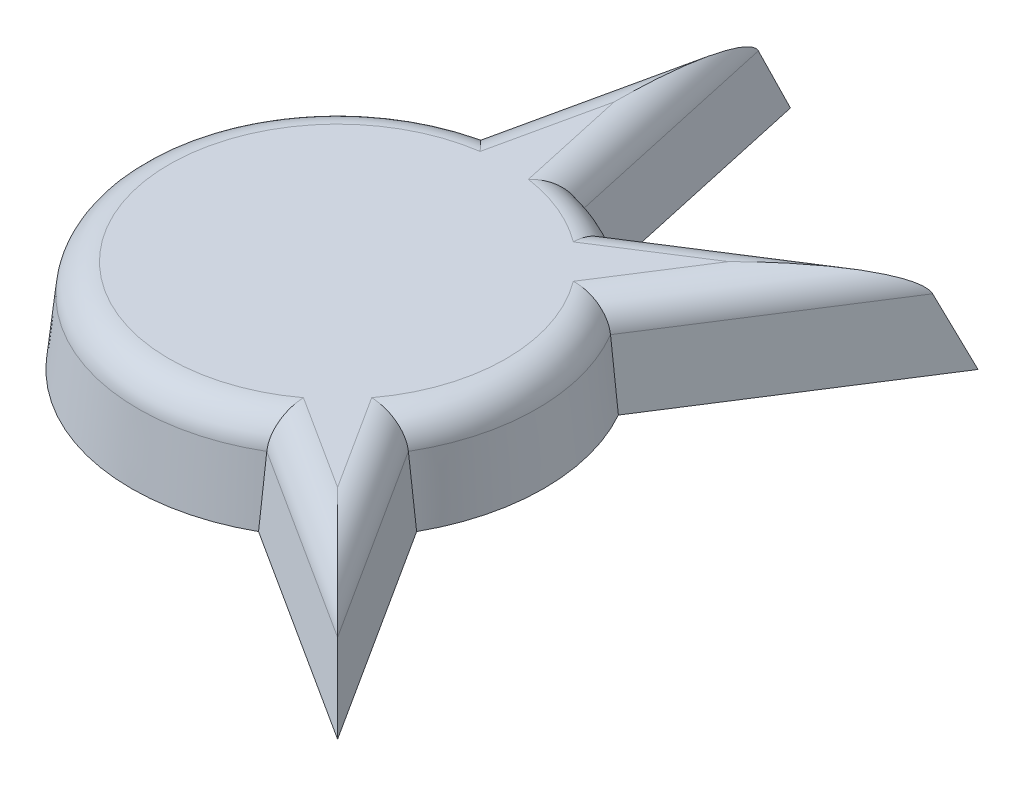
ISO-10303-21;
HEADER;
FILE_DESCRIPTION(('STEP AP214'),'2;1');
FILE_NAME('part.step','',(''),(''),'','','');
FILE_SCHEMA(('AUTOMOTIVE_DESIGN { 1 0 10303 214 1 1 1 1 }'));
ENDSEC;
DATA;
#1=APPLICATION_CONTEXT('core data for automotive mechanical design processes');
#2=APPLICATION_PROTOCOL_DEFINITION('international standard','automotive_design',2000,#1);
#3=PRODUCT_CONTEXT('',#1,'mechanical');
#4=PRODUCT('Part','Part','',(#3));
#5=PRODUCT_RELATED_PRODUCT_CATEGORY('part','',(#4));
#6=PRODUCT_DEFINITION_FORMATION('','',#4);
#7=PRODUCT_DEFINITION_CONTEXT('part definition',#1,'design');
#8=PRODUCT_DEFINITION('design','',#6,#7);
#9=PRODUCT_DEFINITION_SHAPE('','',#8);
#10=(LENGTH_UNIT() NAMED_UNIT(*) SI_UNIT(.MILLI.,.METRE.));
#11=(NAMED_UNIT(*) PLANE_ANGLE_UNIT() SI_UNIT($,.RADIAN.));
#12=(NAMED_UNIT(*) SI_UNIT($,.STERADIAN.) SOLID_ANGLE_UNIT());
#13=UNCERTAINTY_MEASURE_WITH_UNIT(LENGTH_MEASURE(1.E-05),#10,'distance_accuracy_value','');
#14=(GEOMETRIC_REPRESENTATION_CONTEXT(3) GLOBAL_UNCERTAINTY_ASSIGNED_CONTEXT((#13)) GLOBAL_UNIT_ASSIGNED_CONTEXT((#10,
#11,#12)) REPRESENTATION_CONTEXT('',''));
#15=CARTESIAN_POINT('',(0.,0.,0.));
#16=DIRECTION('',(0.,0.,1.));
#17=DIRECTION('',(1.,0.,0.));
#18=AXIS2_PLACEMENT_3D('',#15,#16,#17);
#19=CARTESIAN_POINT('',(0.,0.,0.));
#20=DIRECTION('',(0.,-1.,0.));
#21=DIRECTION('',(0.,0.,1.));
#22=AXIS2_PLACEMENT_3D('',#19,#20,#21);
#23=CONICAL_SURFACE('',#22,6.62463400876314,0.10471975511966);
#24=CARTESIAN_POINT('',(3.24787269852485,3.,5.4091457956168));
#25=CARTESIAN_POINT('',(3.24699003087964,2.50003379183349,5.47095982785389));
#26=CARTESIAN_POINT('',(3.24588174433896,2.00005068603496,5.53263165590073));
#27=CARTESIAN_POINT('',(3.243213933485,1.0000506860345,5.65569090276962));
#28=CARTESIAN_POINT('',(3.2416544091779,0.500033791833026,5.71707832159558));
#29=CARTESIAN_POINT('',(3.23986926598154,0.,5.77832353623518));
#30=B_SPLINE_CURVE_WITH_KNOTS('',3,(#24,#25,#26,#27,#28,#29),.UNSPECIFIED.,.F.,.F.,(4,2,4),(0.,
1.51132052815368,3.02264103557015),.UNSPECIFIED.);
#31=CARTESIAN_POINT('',(3.24605440651761,2.10452846326765,5.51970685719593));
#32=VERTEX_POINT('',#31);
#33=CARTESIAN_POINT('',(3.23986926598154,0.,5.77832353623518));
#34=VERTEX_POINT('',#33);
#35=EDGE_CURVE('E137',#32,#34,#30,.T.);
#36=ORIENTED_EDGE('',*,*,#35,.F.);
#37=CARTESIAN_POINT('',(0.,2.10452846326765,0.));
#38=DIRECTION('',(0.,-1.,0.));
#39=DIRECTION('',(0.,0.,-1.));
#40=AXIS2_PLACEMENT_3D('',#37,#38,#39);
#41=CIRCLE('',#40,6.40343915403654);
#42=CARTESIAN_POINT('',(-1.60771506593602,2.10452846326765,-6.19832923183422));
#43=VERTEX_POINT('',#42);
#44=EDGE_CURVE('E11',#32,#43,#41,.T.);
#45=ORIENTED_EDGE('',*,*,#44,.T.);
#46=CARTESIAN_POINT('',(-1.52825086294973,3.,-6.12143648206492));
#47=CARTESIAN_POINT('',(-1.57258412459453,2.50003379183349,-6.16452146315479));
#48=CARTESIAN_POINT('',(-1.61697636934303,2.00005068603496,-6.20734635404647));
#49=CARTESIAN_POINT('',(-1.70587882443749,1.0000506860345,-6.29247595484942));
#50=CARTESIAN_POINT('',(-1.75038903478184,0.500033791833026,-6.33478066476782));
#51=CARTESIAN_POINT('',(-1.79495822822827,0.,-6.37682528449516));
#52=B_SPLINE_CURVE_WITH_KNOTS('',3,(#46,#47,#48,#49,#50,#51),.UNSPECIFIED.,.F.,.F.,(4,2,4),(0.,
1.51132052815368,3.02264103557015),.UNSPECIFIED.);
#53=CARTESIAN_POINT('',(-1.79495822822827,0.,-6.37682528449516));
#54=VERTEX_POINT('',#53);
#55=EDGE_CURVE('E150',#43,#54,#52,.T.);
#56=ORIENTED_EDGE('',*,*,#55,.T.);
#57=CARTESIAN_POINT('',(0.,0.,0.));
#58=DIRECTION('',(0.,1.,0.));
#59=DIRECTION('',(0.,0.,1.));
#60=AXIS2_PLACEMENT_3D('',#57,#58,#59);
#61=CIRCLE('',#60,6.62463400876314);
#62=EDGE_CURVE('E148',#54,#34,#61,.T.);
#63=ORIENTED_EDGE('',*,*,#62,.T.);
#64=EDGE_LOOP('',(#36,#45,#56,#63));
#65=FACE_BOUND('',#64,.T.);
#66=ADVANCED_FACE('F35',(#65),#23,.T.);
#67=CARTESIAN_POINT('',(-1.68222862987204,0.,2.6300059792289));
#68=DIRECTION('',(-0.535880301772838,0.104528463267654,0.8377983662784));
#69=DIRECTION('',(0.842413193897718,0.,0.538832080287584));
#70=AXIS2_PLACEMENT_3D('',#67,#68,#69);
#71=PLANE('',#70);
#72=DIRECTION('',(-0.310943907825434,0.898124586219804,-0.310943907825437));
#73=VECTOR('',#72,1.);
#74=CARTESIAN_POINT('',(8.38689679368774,5.47919899962963,8.38689679368783));
#75=LINE('',#74,#73);
#76=CARTESIAN_POINT('',(9.55525724200413,2.10452846326765,9.55525724200423));
#77=VERTEX_POINT('',#76);
#78=CARTESIAN_POINT('',(10.2838758707989,0.,10.283875870799));
#79=VERTEX_POINT('',#78);
#80=EDGE_CURVE('E145',#77,#79,#75,.F.);
#81=ORIENTED_EDGE('',*,*,#80,.F.);
#82=DIRECTION('',(-0.842413193897718,0.,-0.538832080287584));
#83=VECTOR('',#82,1.);
#84=CARTESIAN_POINT('',(-1.5630417461508,2.10452846326765,2.44366851518492));
#85=LINE('',#84,#83);
#86=EDGE_CURVE('E49',#77,#32,#85,.T.);
#87=ORIENTED_EDGE('',*,*,#86,.T.);
#88=ORIENTED_EDGE('',*,*,#35,.T.);
#89=DIRECTION('',(-0.842413193897718,0.,-0.538832080287584));
#90=VECTOR('',#89,1.);
#91=CARTESIAN_POINT('',(-1.68222862987204,0.,2.6300059792289));
#92=LINE('',#91,#90);
#93=EDGE_CURVE('E141',#79,#34,#92,.T.);
#94=ORIENTED_EDGE('',*,*,#93,.F.);
#95=EDGE_LOOP('',(#81,#87,#88,#94));
#96=FACE_BOUND('',#95,.T.);
#97=ADVANCED_FACE('F139',(#96),#71,.T.);
#98=CARTESIAN_POINT('',(2.63000597922891,0.,-1.68222862987201));
#99=DIRECTION('',(0.837798366278405,0.104528463267654,-0.535880301772829));
#100=DIRECTION('',(-0.538832080287575,0.,-0.842413193897724));
#101=AXIS2_PLACEMENT_3D('',#98,#99,#100);
#102=PLANE('',#101);
#103=CARTESIAN_POINT('',(5.40914579561676,3.,3.24787269852491));
#104=CARTESIAN_POINT('',(5.47095982785386,2.50003379183349,3.2469900308797));
#105=CARTESIAN_POINT('',(5.53263165590069,2.00005068603496,3.24588174433902));
#106=CARTESIAN_POINT('',(5.65569090276959,1.0000506860345,3.24321393348506));
#107=CARTESIAN_POINT('',(5.71707832159554,0.500033791833026,3.24165440917796));
#108=CARTESIAN_POINT('',(5.77832353623514,0.,3.2398692659816));
#109=B_SPLINE_CURVE_WITH_KNOTS('',3,(#103,#104,#105,#106,#107,#108),.UNSPECIFIED.,.F.,.F.,(4,2,
4),(0.,1.51132052815368,3.02264103557015),.UNSPECIFIED.);
#110=CARTESIAN_POINT('',(5.51970685719591,2.10452846326754,3.24605440651767));
#111=VERTEX_POINT('',#110);
#112=CARTESIAN_POINT('',(5.77832353623514,0.,3.2398692659816));
#113=VERTEX_POINT('',#112);
#114=EDGE_CURVE('E237',#111,#113,#109,.T.);
#115=ORIENTED_EDGE('',*,*,#114,.F.);
#116=DIRECTION('',(-0.538832080287575,0.,-0.842413193897724));
#117=VECTOR('',#116,1.);
#118=CARTESIAN_POINT('',(9.32451797835626,2.10452846326765,9.19451814134885));
#119=LINE('',#118,#117);
#120=EDGE_CURVE('E64',#111,#77,#119,.F.);
#121=ORIENTED_EDGE('',*,*,#120,.T.);
#122=ORIENTED_EDGE('',*,*,#80,.T.);
#123=DIRECTION('',(-0.538832080287575,0.,-0.842413193897724));
#124=VECTOR('',#123,1.);
#125=CARTESIAN_POINT('',(2.63000597922891,0.,-1.68222862987201));
#126=LINE('',#125,#124);
#127=EDGE_CURVE('E161',#79,#113,#126,.T.);
#128=ORIENTED_EDGE('',*,*,#127,.T.);
#129=EDGE_LOOP('',(#115,#121,#122,#128));
#130=FACE_BOUND('',#129,.T.);
#131=ADVANCED_FACE('F243',(#130),#102,.T.);
#132=CARTESIAN_POINT('',(0.,0.,0.));
#133=DIRECTION('',(0.,-1.,0.));
#134=DIRECTION('',(0.,0.,1.));
#135=AXIS2_PLACEMENT_3D('',#132,#133,#134);
#136=CONICAL_SURFACE('',#135,6.62463400876314,0.10471975511966);
#137=CARTESIAN_POINT('',(5.40914579561679,3.,-3.24787269852487));
#138=CARTESIAN_POINT('',(5.47095982785388,2.50003379183349,-3.24699003087966));
#139=CARTESIAN_POINT('',(5.53263165590072,2.00005068603496,-3.24588174433898));
#140=CARTESIAN_POINT('',(5.65569090276961,1.0000506860345,-3.24321393348502));
#141=CARTESIAN_POINT('',(5.71707832159557,0.500033791833026,-3.24165440917792));
#142=CARTESIAN_POINT('',(5.77832353623517,0.,-3.23986926598156));
#143=B_SPLINE_CURVE_WITH_KNOTS('',3,(#137,#138,#139,#140,#141,#142),.UNSPECIFIED.,.F.,.F.,(4,2,
4),(0.,1.51132052815368,3.02264103557016),.UNSPECIFIED.);
#144=CARTESIAN_POINT('',(5.51970685719592,2.10452846326765,-3.24605440651763));
#145=VERTEX_POINT('',#144);
#146=CARTESIAN_POINT('',(5.77832353623517,0.,-3.23986926598156));
#147=VERTEX_POINT('',#146);
#148=EDGE_CURVE('E232',#145,#147,#143,.T.);
#149=ORIENTED_EDGE('',*,*,#148,.F.);
#150=CARTESIAN_POINT('',(0.,2.10452846326765,0.));
#151=DIRECTION('',(0.,-1.,0.));
#152=DIRECTION('',(0.,0.,-1.));
#153=AXIS2_PLACEMENT_3D('',#150,#151,#152);
#154=CIRCLE('',#153,6.40343915403654);
#155=EDGE_CURVE('E326',#145,#111,#154,.T.);
#156=ORIENTED_EDGE('',*,*,#155,.T.);
#157=ORIENTED_EDGE('',*,*,#114,.T.);
#158=EDGE_CURVE('E156',#113,#147,#61,.T.);
#159=ORIENTED_EDGE('',*,*,#158,.T.);
#160=EDGE_LOOP('',(#149,#156,#157,#159));
#161=FACE_BOUND('',#160,.T.);
#162=ADVANCED_FACE('F228',(#161),#136,.T.);
#163=CARTESIAN_POINT('',(2.6300059792289,0.,1.68222862987203));
#164=DIRECTION('',(0.837798366278402,0.104528463267654,0.535880301772835));
#165=DIRECTION('',(0.538832080287581,0.,-0.84241319389772));
#166=AXIS2_PLACEMENT_3D('',#163,#164,#165);
#167=PLANE('',#166);
#168=DIRECTION('',(-0.310943907825436,0.898124586219804,0.310943907825435));
#169=VECTOR('',#168,1.);
#170=CARTESIAN_POINT('',(8.3868967936878,5.47919899962963,-8.38689679368777));
#171=LINE('',#170,#169);
#172=CARTESIAN_POINT('',(9.5552572420042,2.10452846326765,-9.55525724200417));
#173=VERTEX_POINT('',#172);
#174=CARTESIAN_POINT('',(10.2838758707989,0.,-10.2838758707989));
#175=VERTEX_POINT('',#174);
#176=EDGE_CURVE('E217',#173,#175,#171,.F.);
#177=ORIENTED_EDGE('',*,*,#176,.F.);
#178=DIRECTION('',(-0.538832080287581,0.,0.84241319389772));
#179=VECTOR('',#178,1.);
#180=CARTESIAN_POINT('',(2.44366851518493,2.10452846326765,1.56304174615079));
#181=LINE('',#180,#179);
#182=EDGE_CURVE('E356',#173,#145,#181,.T.);
#183=ORIENTED_EDGE('',*,*,#182,.T.);
#184=ORIENTED_EDGE('',*,*,#148,.T.);
#185=DIRECTION('',(-0.538832080287581,0.,0.84241319389772));
#186=VECTOR('',#185,1.);
#187=CARTESIAN_POINT('',(2.6300059792289,0.,1.68222862987203));
#188=LINE('',#187,#186);
#189=EDGE_CURVE('E165',#175,#147,#188,.T.);
#190=ORIENTED_EDGE('',*,*,#189,.F.);
#191=EDGE_LOOP('',(#177,#183,#184,#190));
#192=FACE_BOUND('',#191,.T.);
#193=ADVANCED_FACE('F223',(#192),#167,.T.);
#194=CARTESIAN_POINT('',(-1.68222862987203,0.,-2.63000597922891));
#195=DIRECTION('',(-0.535880301772832,0.104528463267654,-0.837798366278403));
#196=DIRECTION('',(-0.842413193897722,0.,0.538832080287578));
#197=AXIS2_PLACEMENT_3D('',#194,#195,#196);
#198=PLANE('',#197);
#199=CARTESIAN_POINT('',(3.24787269852489,3.,-5.40914579561678));
#200=CARTESIAN_POINT('',(3.24699003087967,2.50003379183349,-5.47095982785387));
#201=CARTESIAN_POINT('',(3.245881744339,2.00005068603496,-5.53263165590071));
#202=CARTESIAN_POINT('',(3.24321393348504,1.0000506860345,-5.6556909027696));
#203=CARTESIAN_POINT('',(3.24165440917794,0.500033791833026,-5.71707832159556));
#204=CARTESIAN_POINT('',(3.23986926598158,0.,-5.77832353623516));
#205=B_SPLINE_CURVE_WITH_KNOTS('',3,(#199,#200,#201,#202,#203,#204),.UNSPECIFIED.,.F.,.F.,(4,2,
4),(0.,1.51132052815368,3.02264103557016),.UNSPECIFIED.);
#206=CARTESIAN_POINT('',(3.24605440651765,2.10452846326765,-5.51970685719591));
#207=VERTEX_POINT('',#206);
#208=CARTESIAN_POINT('',(3.23986926598158,0.,-5.77832353623516));
#209=VERTEX_POINT('',#208);
#210=EDGE_CURVE('E211',#207,#209,#205,.T.);
#211=ORIENTED_EDGE('',*,*,#210,.F.);
#212=DIRECTION('',(-0.842413193897722,0.,0.538832080287578));
#213=VECTOR('',#212,1.);
#214=CARTESIAN_POINT('',(9.19451814134882,2.10452846326765,-9.3245179783563));
#215=LINE('',#214,#213);
#216=EDGE_CURVE('E354',#207,#173,#215,.F.);
#217=ORIENTED_EDGE('',*,*,#216,.T.);
#218=ORIENTED_EDGE('',*,*,#176,.T.);
#219=DIRECTION('',(-0.842413193897722,0.,0.538832080287578));
#220=VECTOR('',#219,1.);
#221=CARTESIAN_POINT('',(-1.68222862987203,0.,-2.63000597922891));
#222=LINE('',#221,#220);
#223=EDGE_CURVE('E168',#175,#209,#222,.T.);
#224=ORIENTED_EDGE('',*,*,#223,.T.);
#225=EDGE_LOOP('',(#211,#217,#218,#224));
#226=FACE_BOUND('',#225,.T.);
#227=ADVANCED_FACE('F219',(#226),#198,.T.);
#228=CARTESIAN_POINT('',(0.,0.,0.));
#229=DIRECTION('',(0.,-1.,0.));
#230=DIRECTION('',(0.,0.,1.));
#231=AXIS2_PLACEMENT_3D('',#228,#229,#230);
#232=CONICAL_SURFACE('',#231,6.62463400876314,0.10471975511966);
#233=CARTESIAN_POINT('',(1.52825086294973,3.,-6.12143648206492));
#234=CARTESIAN_POINT('',(1.57258412459453,2.50003379183349,-6.16452146315479));
#235=CARTESIAN_POINT('',(1.61697636934303,2.00005068603496,-6.20734635404647));
#236=CARTESIAN_POINT('',(1.70587882443749,1.0000506860345,-6.29247595484942));
#237=CARTESIAN_POINT('',(1.75038903478184,0.500033791833026,-6.33478066476782));
#238=CARTESIAN_POINT('',(1.79495822822827,0.,-6.37682528449516));
#239=B_SPLINE_CURVE_WITH_KNOTS('',3,(#233,#234,#235,#236,#237,#238),.UNSPECIFIED.,.F.,.F.,(4,2,
4),(0.,1.51132052815368,3.02264103557015),.UNSPECIFIED.);
#240=CARTESIAN_POINT('',(1.60771506593602,2.10452846326765,-6.19832923183422));
#241=VERTEX_POINT('',#240);
#242=CARTESIAN_POINT('',(1.79495822822827,0.,-6.37682528449516));
#243=VERTEX_POINT('',#242);
#244=EDGE_CURVE('E206',#241,#243,#239,.T.);
#245=ORIENTED_EDGE('',*,*,#244,.F.);
#246=CARTESIAN_POINT('',(0.,2.10452846326765,0.));
#247=DIRECTION('',(0.,-1.,0.));
#248=DIRECTION('',(0.,0.,-1.));
#249=AXIS2_PLACEMENT_3D('',#246,#247,#248);
#250=CIRCLE('',#249,6.40343915403654);
#251=EDGE_CURVE('E352',#241,#207,#250,.T.);
#252=ORIENTED_EDGE('',*,*,#251,.T.);
#253=ORIENTED_EDGE('',*,*,#210,.T.);
#254=EDGE_CURVE('E155',#209,#243,#61,.T.);
#255=ORIENTED_EDGE('',*,*,#254,.T.);
#256=EDGE_LOOP('',(#245,#252,#253,#255));
#257=FACE_BOUND('',#256,.T.);
#258=ADVANCED_FACE('F201',(#257),#232,.T.);
#259=CARTESIAN_POINT('',(3.04921033416259,0.,-0.670179790785258));
#260=DIRECTION('',(0.971337501350333,0.104528463267654,-0.213488310774605));
#261=DIRECTION('',(-0.214664264073895,0.,-0.976687899858298));
#262=AXIS2_PLACEMENT_3D('',#259,#260,#261);
#263=PLANE('',#262);
#264=DIRECTION('',(0.,0.898124586219804,0.43974109158402));
#265=VECTOR('',#264,1.);
#266=CARTESIAN_POINT('',(0.,5.47919899962963,-11.8608631918567));
#267=LINE('',#266,#265);
#268=CARTESIAN_POINT('',(0.,2.10452846326765,-13.513174383606));
#269=VERTEX_POINT('',#268);
#270=CARTESIAN_POINT('',(0.,0.,-14.5435967302452));
#271=VERTEX_POINT('',#270);
#272=EDGE_CURVE('E212',#269,#271,#267,.F.);
#273=ORIENTED_EDGE('',*,*,#272,.F.);
#274=DIRECTION('',(0.214664264073895,0.,0.976687899858298));
#275=VECTOR('',#274,1.);
#276=CARTESIAN_POINT('',(2.83317199604021,2.10452846326765,-0.622697160078441));
#277=LINE('',#276,#275);
#278=EDGE_CURVE('E350',#269,#241,#277,.T.);
#279=ORIENTED_EDGE('',*,*,#278,.T.);
#280=ORIENTED_EDGE('',*,*,#244,.T.);
#281=DIRECTION('',(0.214664264073895,0.,0.976687899858298));
#282=VECTOR('',#281,1.);
#283=CARTESIAN_POINT('',(3.04921033416259,0.,-0.670179790785258));
#284=LINE('',#283,#282);
#285=EDGE_CURVE('E171',#271,#243,#284,.T.);
#286=ORIENTED_EDGE('',*,*,#285,.F.);
#287=EDGE_LOOP('',(#273,#279,#280,#286));
#288=FACE_BOUND('',#287,.T.);
#289=ADVANCED_FACE('F196',(#288),#263,.T.);
#290=CARTESIAN_POINT('',(-3.04921033416259,0.,-0.670179790785258));
#291=DIRECTION('',(-0.971337501350333,0.104528463267654,-0.213488310774605));
#292=DIRECTION('',(-0.214664264073895,0.,0.976687899858298));
#293=AXIS2_PLACEMENT_3D('',#290,#291,#292);
#294=PLANE('',#293);
#295=ORIENTED_EDGE('',*,*,#55,.F.);
#296=DIRECTION('',(-0.214664264073895,0.,0.976687899858298));
#297=VECTOR('',#296,1.);
#298=CARTESIAN_POINT('',(-0.0919237663011577,2.10452846326765,-13.0949360212821));
#299=LINE('',#298,#297);
#300=EDGE_CURVE('E347',#43,#269,#299,.F.);
#301=ORIENTED_EDGE('',*,*,#300,.T.);
#302=ORIENTED_EDGE('',*,*,#272,.T.);
#303=DIRECTION('',(-0.214664264073895,0.,0.976687899858298));
#304=VECTOR('',#303,1.);
#305=CARTESIAN_POINT('',(-3.04921033416259,0.,-0.670179790785258));
#306=LINE('',#305,#304);
#307=EDGE_CURVE('E174',#271,#54,#306,.T.);
#308=ORIENTED_EDGE('',*,*,#307,.T.);
#309=EDGE_LOOP('',(#295,#301,#302,#308));
#310=FACE_BOUND('',#309,.T.);
#311=ADVANCED_FACE('F190',(#310),#294,.T.);
#312=CARTESIAN_POINT('',(0.,3.,0.));
#313=DIRECTION('',(0.,1.,0.));
#314=DIRECTION('',(0.,0.,1.));
#315=AXIS2_PLACEMENT_3D('',#312,#313,#314);
#316=PLANE('',#315);
#317=DIRECTION('',(0.214664264073895,0.,0.976687899858298));
#318=VECTOR('',#317,1.);
#319=CARTESIAN_POINT('',(1.86183449468988,3.,-0.409208849303836));
#320=LINE('',#319,#318);
#321=CARTESIAN_POINT('',(0.775232353328907,3.,-5.35307394956128));
#322=VERTEX_POINT('',#321);
#323=CARTESIAN_POINT('',(0.,3.,-8.88025655883981));
#324=VERTEX_POINT('',#323);
#325=EDGE_CURVE('E342',#322,#324,#320,.F.);
#326=ORIENTED_EDGE('',*,*,#325,.T.);
#327=DIRECTION('',(0.214664264073895,0.,-0.976687899858298));
#328=VECTOR('',#327,1.);
#329=CARTESIAN_POINT('',(-0.648837127900559,3.,-5.92815191052657));
#330=LINE('',#329,#328);
#331=CARTESIAN_POINT('',(-0.775232353328907,3.,-5.35307394956128));
#332=VERTEX_POINT('',#331);
#333=EDGE_CURVE('E344',#324,#332,#330,.F.);
#334=ORIENTED_EDGE('',*,*,#333,.T.);
#335=CARTESIAN_POINT('',(0.,3.,0.));
#336=DIRECTION('',(0.,1.,0.));
#337=DIRECTION('',(0.,0.,1.));
#338=AXIS2_PLACEMENT_3D('',#335,#336,#337);
#339=CIRCLE('',#338,5.40891725866827);
#340=CARTESIAN_POINT('',(3.23702283589374,3.,4.33336694396193));
#341=VERTEX_POINT('',#340);
#342=EDGE_CURVE('E144',#332,#341,#339,.T.);
#343=ORIENTED_EDGE('',*,*,#342,.T.);
#344=DIRECTION('',(-0.842413193897718,0.,-0.538832080287584));
#345=VECTOR('',#344,1.);
#346=CARTESIAN_POINT('',(-1.02716144437796,3.,1.60587014890652));
#347=LINE('',#346,#345);
#348=CARTESIAN_POINT('',(6.27928963143191,3.,6.27928963143198));
#349=VERTEX_POINT('',#348);
#350=EDGE_CURVE('E335',#341,#349,#347,.F.);
#351=ORIENTED_EDGE('',*,*,#350,.T.);
#352=DIRECTION('',(0.538832080287575,0.,0.842413193897724));
#353=VECTOR('',#352,1.);
#354=CARTESIAN_POINT('',(4.65063354886139,3.,3.73303928281326));
#355=LINE('',#354,#353);
#356=CARTESIAN_POINT('',(4.33336694396189,3.,3.23702283589378));
#357=VERTEX_POINT('',#356);
#358=EDGE_CURVE('E320',#349,#357,#355,.F.);
#359=ORIENTED_EDGE('',*,*,#358,.T.);
#360=CARTESIAN_POINT('',(0.,3.,0.));
#361=DIRECTION('',(0.,1.,0.));
#362=DIRECTION('',(0.,0.,1.));
#363=AXIS2_PLACEMENT_3D('',#360,#361,#362);
#364=CIRCLE('',#363,5.40891725866827);
#365=CARTESIAN_POINT('',(4.33336694396192,3.,-3.23702283589375));
#366=VERTEX_POINT('',#365);
#367=EDGE_CURVE('E327',#357,#366,#364,.T.);
#368=ORIENTED_EDGE('',*,*,#367,.T.);
#369=DIRECTION('',(-0.538832080287581,0.,0.84241319389772));
#370=VECTOR('',#369,1.);
#371=CARTESIAN_POINT('',(1.60587014890653,3.,1.02716144437796));
#372=LINE('',#371,#370);
#373=CARTESIAN_POINT('',(6.27928963143196,3.,-6.27928963143194));
#374=VERTEX_POINT('',#373);
#375=EDGE_CURVE('E331',#366,#374,#372,.F.);
#376=ORIENTED_EDGE('',*,*,#375,.T.);
#377=DIRECTION('',(0.842413193897722,0.,-0.538832080287578));
#378=VECTOR('',#377,1.);
#379=CARTESIAN_POINT('',(3.73303928281324,3.,-4.65063354886141));
#380=LINE('',#379,#378);
#381=CARTESIAN_POINT('',(3.23702283589376,3.,-4.33336694396191));
#382=VERTEX_POINT('',#381);
#383=EDGE_CURVE('E333',#374,#382,#380,.F.);
#384=ORIENTED_EDGE('',*,*,#383,.T.);
#385=CARTESIAN_POINT('',(0.,3.,0.));
#386=DIRECTION('',(0.,1.,0.));
#387=DIRECTION('',(0.,0.,1.));
#388=AXIS2_PLACEMENT_3D('',#385,#386,#387);
#389=CIRCLE('',#388,5.40891725866827);
#390=EDGE_CURVE('E340',#382,#322,#389,.T.);
#391=ORIENTED_EDGE('',*,*,#390,.T.);
#392=EDGE_LOOP('',(#326,#334,#343,#351,#359,#368,#376,#384,#391));
#393=FACE_BOUND('',#392,.T.);
#394=ADVANCED_FACE('F195',(#393),#316,.T.);
#395=CARTESIAN_POINT('',(0.,0.,0.));
#396=DIRECTION('',(0.,1.,0.));
#397=DIRECTION('',(0.,0.,1.));
#398=AXIS2_PLACEMENT_3D('',#395,#396,#397);
#399=PLANE('',#398);
#400=ORIENTED_EDGE('',*,*,#62,.F.);
#401=ORIENTED_EDGE('',*,*,#307,.F.);
#402=ORIENTED_EDGE('',*,*,#285,.T.);
#403=ORIENTED_EDGE('',*,*,#254,.F.);
#404=ORIENTED_EDGE('',*,*,#223,.F.);
#405=ORIENTED_EDGE('',*,*,#189,.T.);
#406=ORIENTED_EDGE('',*,*,#158,.F.);
#407=ORIENTED_EDGE('',*,*,#127,.F.);
#408=ORIENTED_EDGE('',*,*,#93,.T.);
#409=EDGE_LOOP('',(#400,#401,#402,#403,#404,#405,#406,#407,#408));
#410=FACE_BOUND('',#409,.T.);
#411=ADVANCED_FACE('F158',(#410),#399,.F.);
#412=CARTESIAN_POINT('',(1.60587014890653,2.,1.02716144437796));
#413=DIRECTION('',(-0.538832080287581,0.,0.84241319389772));
#414=DIRECTION('',(0.84241319389772,0.,0.538832080287581));
#415=AXIS2_PLACEMENT_3D('',#412,#413,#414);
#416=CYLINDRICAL_SURFACE('',#415,1.);
#417=CARTESIAN_POINT('',(6.27928963143196,2.,-6.27928963143194));
#418=DIRECTION('',(0.707106781186546,0.,0.707106781186549));
#419=DIRECTION('',(-0.707106781186549,0.,0.707106781186546));
#420=AXIS2_PLACEMENT_3D('',#417,#418,#419);
#421=ELLIPSE('',#420,4.65843723133984,1.);
#422=EDGE_CURVE('E307',#374,#173,#421,.F.);
#423=ORIENTED_EDGE('',*,*,#422,.F.);
#424=ORIENTED_EDGE('',*,*,#375,.F.);
#425=CARTESIAN_POINT('',(5.51970685719592,2.10452846326765,-3.24605440651763));
#426=CARTESIAN_POINT('',(5.5165469575786,2.13017395544137,-3.24611330600958));
#427=CARTESIAN_POINT('',(5.51222517391744,2.15566076925377,-3.24619388035699));
#428=CARTESIAN_POINT('',(5.50133072018969,2.2061355742757,-3.24639218674731));
#429=CARTESIAN_POINT('',(5.49475918820588,2.23112381095022,-3.24650990000037));
#430=CARTESIAN_POINT('',(5.47186329329073,2.30481550702428,-3.24690801887299));
#431=CARTESIAN_POINT('',(5.45231841673779,2.35255334724184,-3.24723424817988));
#432=CARTESIAN_POINT('',(5.4056362774723,2.44399657939179,-3.24793334732942));
#433=CARTESIAN_POINT('',(5.37851139521694,2.48770839354772,-3.24830614057447));
#434=CARTESIAN_POINT('',(5.31776577942389,2.57040162048487,-3.24901018876703));
#435=CARTESIAN_POINT('',(5.284137939237,2.60937778140728,-3.2493413976106));
#436=CARTESIAN_POINT('',(5.20895015042404,2.68463433744053,-3.24989066484812));
#437=CARTESIAN_POINT('',(5.16699221619275,2.72051533703873,-3.25009879660896));
#438=CARTESIAN_POINT('',(5.07833942035271,2.78582419284886,-3.25026152389245));
#439=CARTESIAN_POINT('',(5.03164259971389,2.81524936423187,-3.25021601413843));
#440=CARTESIAN_POINT('',(4.92733522723785,2.87152696587277,-3.24975341558934));
#441=CARTESIAN_POINT('',(4.86914593764618,2.89730407713894,-3.24928076099643));
#442=CARTESIAN_POINT('',(4.74968281244223,2.94020758421309,-3.24778671199104));
#443=CARTESIAN_POINT('',(4.68840835123394,2.95733221768225,-3.2467652058757));
#444=CARTESIAN_POINT('',(4.57917655807584,2.97999387963477,-3.24443340926538));
#445=CARTESIAN_POINT('',(4.53157628996015,2.98733046284243,-3.24325241203875));
#446=CARTESIAN_POINT('',(4.43594046321751,2.99721667357886,-3.24052735814418));
#447=CARTESIAN_POINT('',(4.38790561227541,2.99977303019609,-3.2389838152819));
#448=CARTESIAN_POINT('',(4.33772255027902,2.99999518630591,-3.23718048330154));
#449=CARTESIAN_POINT('',(4.33554470346919,3.00000000344737,-3.23710184639162));
#450=CARTESIAN_POINT('',(4.33336694396192,3.,-3.23702283589375));
#451=B_SPLINE_CURVE_WITH_KNOTS('',3,(#425,#426,#427,#428,#429,#430,#431,#432,#433,#434,#435,
#436,#437,#438,#439,#440,#441,#442,#443,#444,#445,#446,#447,#448,#449,#450),.UNSPECIFIED.,.F.,
.F.,(4,2,2,2,2,2,2,2,2,2,2,2,4),(0.,0.0774632524831685,0.154887376303542,0.308819029238617,
0.462500719791221,0.616351317746332,0.781339193288912,0.946395553937745,1.13660380487697,
1.32685078187831,1.47115912056896,1.61526416414079,1.62180195209039),.UNSPECIFIED.);
#452=EDGE_CURVE('E40',#145,#366,#451,.T.);
#453=ORIENTED_EDGE('',*,*,#452,.F.);
#454=ORIENTED_EDGE('',*,*,#182,.F.);
#455=EDGE_LOOP('',(#423,#424,#453,#454));
#456=FACE_BOUND('',#455,.T.);
#457=ADVANCED_FACE('F37',(#456),#416,.T.);
#458=CARTESIAN_POINT('',(0.,2.,0.));
#459=DIRECTION('',(0.,1.,0.));
#460=DIRECTION('',(0.,0.,1.));
#461=AXIS2_PLACEMENT_3D('',#458,#459,#460);
#462=TOROIDAL_SURFACE('',#461,5.40891725866827,1.);
#463=ORIENTED_EDGE('',*,*,#452,.T.);
#464=ORIENTED_EDGE('',*,*,#367,.F.);
#465=CARTESIAN_POINT('',(5.51970685719639,2.10452846326765,3.24605440651844));
#466=CARTESIAN_POINT('',(5.51654695757876,2.13017395544132,3.24611330600991));
#467=CARTESIAN_POINT('',(5.51222517391749,2.15566076925369,3.2461938803571));
#468=CARTESIAN_POINT('',(5.50133072018964,2.2061355742756,3.24639218674727));
#469=CARTESIAN_POINT('',(5.49475918820586,2.23112381095013,3.24650990000038));
#470=CARTESIAN_POINT('',(5.47186329329077,2.30481550702421,3.24690801887308));
#471=CARTESIAN_POINT('',(5.45231841673781,2.35255334724179,3.24723424817993));
#472=CARTESIAN_POINT('',(5.40563627747229,2.44399657939175,3.24793334732945));
#473=CARTESIAN_POINT('',(5.37851139521694,2.48770839354769,3.2483061405745));
#474=CARTESIAN_POINT('',(5.31776577942389,2.57040162048484,3.24901018876707));
#475=CARTESIAN_POINT('',(5.284137939237,2.60937778140726,3.24934139761064));
#476=CARTESIAN_POINT('',(5.20895015042405,2.68463433744051,3.24989066484816));
#477=CARTESIAN_POINT('',(5.16699221619275,2.7205153370387,3.25009879660899));
#478=CARTESIAN_POINT('',(5.07833942035272,2.78582419284884,3.25026152389248));
#479=CARTESIAN_POINT('',(5.0316425997139,2.81524936423185,3.25021601413847));
#480=CARTESIAN_POINT('',(4.92733522723787,2.87152696587276,3.24975341558938));
#481=CARTESIAN_POINT('',(4.8691459376462,2.89730407713892,3.24928076099646));
#482=CARTESIAN_POINT('',(4.74968281244225,2.94020758421308,3.24778671199108));
#483=CARTESIAN_POINT('',(4.68840835123397,2.95733221768224,3.24676520587576));
#484=CARTESIAN_POINT('',(4.57917655807586,2.97999387963476,3.24443340926539));
#485=CARTESIAN_POINT('',(4.53157628996015,2.98733046284243,3.24325241203873));
#486=CARTESIAN_POINT('',(4.4359404632175,2.99721667357886,3.24052735814426));
#487=CARTESIAN_POINT('',(4.38790561227538,2.99977303019609,3.23898381528212));
#488=CARTESIAN_POINT('',(4.33772255027899,2.99999518630591,3.23718048330158));
#489=CARTESIAN_POINT('',(4.33554470346917,3.00000000344737,3.23710184639165));
#490=CARTESIAN_POINT('',(4.33336694396189,3.,3.23702283589378));
#491=B_SPLINE_CURVE_WITH_KNOTS('',3,(#465,#466,#467,#468,#469,#470,#471,#472,#473,#474,#475,
#476,#477,#478,#479,#480,#481,#482,#483,#484,#485,#486,#487,#488,#489,#490),.UNSPECIFIED.,.F.,
.F.,(4,2,2,2,2,2,2,2,2,2,2,2,4),(0.,0.0774632524831503,0.154887376303527,0.308819029238649,
0.462500719791267,0.616351317746376,0.78133919328895,0.946395553937783,1.136603804877,
1.32685078187834,1.47115912056902,1.61526416414087,1.62180195209047),.UNSPECIFIED.);
#492=EDGE_CURVE('E301',#111,#357,#491,.T.);
#493=ORIENTED_EDGE('',*,*,#492,.F.);
#494=ORIENTED_EDGE('',*,*,#155,.F.);
#495=EDGE_LOOP('',(#463,#464,#493,#494));
#496=FACE_BOUND('',#495,.T.);
#497=ADVANCED_FACE('F308',(#496),#462,.T.);
#498=CARTESIAN_POINT('',(-1.02716144437795,2.,-1.60587014890653));
#499=DIRECTION('',(-0.842413193897722,0.,0.538832080287578));
#500=DIRECTION('',(0.538832080287578,0.,0.842413193897722));
#501=AXIS2_PLACEMENT_3D('',#498,#499,#500);
#502=CYLINDRICAL_SURFACE('',#501,1.);
#503=ORIENTED_EDGE('',*,*,#422,.T.);
#504=ORIENTED_EDGE('',*,*,#216,.F.);
#505=CARTESIAN_POINT('',(3.24605440651765,2.10452846326765,-5.51970685719591));
#506=CARTESIAN_POINT('',(3.2461133060096,2.13017395544137,-5.51654695757859));
#507=CARTESIAN_POINT('',(3.246193880357,2.15566076925377,-5.51222517391743));
#508=CARTESIAN_POINT('',(3.24639218674733,2.2061355742757,-5.50133072018968));
#509=CARTESIAN_POINT('',(3.24650990000039,2.23112381095022,-5.49475918820587));
#510=CARTESIAN_POINT('',(3.24690801887301,2.30481550702428,-5.47186329329072));
#511=CARTESIAN_POINT('',(3.2472342481799,2.35255334724184,-5.45231841673778));
#512=CARTESIAN_POINT('',(3.24793334732944,2.44399657939179,-5.40563627747229));
#513=CARTESIAN_POINT('',(3.24830614057448,2.48770839354772,-5.37851139521693));
#514=CARTESIAN_POINT('',(3.24901018876704,2.57040162048487,-5.31776577942388));
#515=CARTESIAN_POINT('',(3.24934139761062,2.60937778140728,-5.28413793923699));
#516=CARTESIAN_POINT('',(3.24989066484814,2.68463433744053,-5.20895015042403));
#517=CARTESIAN_POINT('',(3.25009879660897,2.72051533703873,-5.16699221619274));
#518=CARTESIAN_POINT('',(3.25026152389246,2.78582419284886,-5.0783394203527));
#519=CARTESIAN_POINT('',(3.25021601413845,2.81524936423187,-5.03164259971388));
#520=CARTESIAN_POINT('',(3.24975341558936,2.87152696587277,-4.92733522723784));
#521=CARTESIAN_POINT('',(3.24928076099645,2.89730407713894,-4.86914593764617));
#522=CARTESIAN_POINT('',(3.24778671199106,2.94020758421309,-4.74968281244222));
#523=CARTESIAN_POINT('',(3.24676520587572,2.95733221768225,-4.68840835123393));
#524=CARTESIAN_POINT('',(3.24443340926539,2.97999387963477,-4.57917655807583));
#525=CARTESIAN_POINT('',(3.24325241203877,2.98733046284243,-4.53157628996013));
#526=CARTESIAN_POINT('',(3.2405273581442,2.99721667357886,-4.4359404632175));
#527=CARTESIAN_POINT('',(3.23898381528191,2.99977303019609,-4.3879056122754));
#528=CARTESIAN_POINT('',(3.23718048330155,2.99999518630591,-4.33772255027901));
#529=CARTESIAN_POINT('',(3.23710184639163,3.00000000344737,-4.33554470346918));
#530=CARTESIAN_POINT('',(3.23702283589377,3.,-4.33336694396191));
#531=B_SPLINE_CURVE_WITH_KNOTS('',3,(#505,#506,#507,#508,#509,#510,#511,#512,#513,#514,#515,
#516,#517,#518,#519,#520,#521,#522,#523,#524,#525,#526,#527,#528,#529,#530),.UNSPECIFIED.,.F.,
.F.,(4,2,2,2,2,2,2,2,2,2,2,2,4),(0.,0.0774632524831682,0.154887376303542,0.308819029238617,
0.462500719791221,0.616351317746331,0.781339193288912,0.946395553937745,1.13660380487697,
1.32685078187831,1.47115912056896,1.61526416414079,1.62180195209039),.UNSPECIFIED.);
#532=EDGE_CURVE('E295',#382,#207,#531,.F.);
#533=ORIENTED_EDGE('',*,*,#532,.F.);
#534=ORIENTED_EDGE('',*,*,#383,.F.);
#535=EDGE_LOOP('',(#503,#504,#533,#534));
#536=FACE_BOUND('',#535,.T.);
#537=ADVANCED_FACE('F291',(#536),#502,.T.);
#538=CARTESIAN_POINT('',(1.60587014890653,2.,-1.02716144437795));
#539=DIRECTION('',(-0.538832080287575,0.,-0.842413193897724));
#540=DIRECTION('',(-0.842413193897724,0.,0.538832080287575));
#541=AXIS2_PLACEMENT_3D('',#538,#539,#540);
#542=CYLINDRICAL_SURFACE('',#541,1.);
#543=ORIENTED_EDGE('',*,*,#492,.T.);
#544=ORIENTED_EDGE('',*,*,#358,.F.);
#545=CARTESIAN_POINT('',(6.27928963143191,2.,6.27928963143198));
#546=DIRECTION('',(-0.707106781186551,0.,0.707106781186544));
#547=DIRECTION('',(-0.707106781186544,0.,-0.707106781186551));
#548=AXIS2_PLACEMENT_3D('',#545,#546,#547);
#549=ELLIPSE('',#548,4.65843723133985,1.);
#550=EDGE_CURVE('E302',#77,#349,#549,.T.);
#551=ORIENTED_EDGE('',*,*,#550,.F.);
#552=ORIENTED_EDGE('',*,*,#120,.F.);
#553=EDGE_LOOP('',(#543,#544,#551,#552));
#554=FACE_BOUND('',#553,.T.);
#555=ADVANCED_FACE('F289',(#554),#542,.T.);
#556=CARTESIAN_POINT('',(0.,2.,0.));
#557=DIRECTION('',(0.,1.,0.));
#558=DIRECTION('',(0.,0.,1.));
#559=AXIS2_PLACEMENT_3D('',#556,#557,#558);
#560=TOROIDAL_SURFACE('',#559,5.40891725866827,1.);
#561=ORIENTED_EDGE('',*,*,#532,.T.);
#562=ORIENTED_EDGE('',*,*,#251,.F.);
#563=CARTESIAN_POINT('',(1.60771506593602,2.10452846326765,-6.19832923183422));
#564=CARTESIAN_POINT('',(1.60543903125857,2.13017395544137,-6.19613649361711));
#565=CARTESIAN_POINT('',(1.60232609405751,2.15566076925377,-6.19313750575092));
#566=CARTESIAN_POINT('',(1.59448232815594,2.2061355742757,-6.18557418743605));
#567=CARTESIAN_POINT('',(1.58975231748793,2.23112381095022,-6.18101064844699));
#568=CARTESIAN_POINT('',(1.57328096237755,2.30481550702428,-6.1651023184457));
#569=CARTESIAN_POINT('',(1.55922996867439,2.35255334724184,-6.15151268265279));
#570=CARTESIAN_POINT('',(1.5257263736901,2.44399657939179,-6.11899776316723));
#571=CARTESIAN_POINT('',(1.5062825808769,2.48770839354772,-6.10008117961713));
#572=CARTESIAN_POINT('',(1.46283110677104,2.57040162048487,-6.05762538001375));
#573=CARTESIAN_POINT('',(1.43881843291895,2.60937778140728,-6.03408110620022));
#574=CARTESIAN_POINT('',(1.38526424699855,2.68463433744053,-5.98130370145649));
#575=CARTESIAN_POINT('',(1.35544833579956,2.72051533703873,-5.95178213301643));
#576=CARTESIAN_POINT('',(1.29264627712428,2.78582419284886,-5.88921020547243));
#577=CARTESIAN_POINT('',(1.25965881884639,2.81524936423187,-5.8561583866832));
#578=CARTESIAN_POINT('',(1.18622947501187,2.87152696587277,-5.78207482970662));
#579=CARTESIAN_POINT('',(1.14541765101697,2.89730407713894,-5.74059457117611));
#580=CARTESIAN_POINT('',(1.06200091726666,2.94020758421309,-5.65506493305952));
#581=CARTESIAN_POINT('',(1.01939564413391,2.95733221768225,-5.6110150321244));
#582=CARTESIAN_POINT('',(0.94380593166615,2.97999387963477,-5.53212766126565));
#583=CARTESIAN_POINT('',(0.910982550442739,2.98733046284243,-5.49763409774724));
#584=CARTESIAN_POINT('',(0.845284712916627,2.99721667357886,-5.42808245204516));
#585=CARTESIAN_POINT('',(0.812410393707199,2.99977303019609,-5.39302523358569));
#586=CARTESIAN_POINT('',(0.778200758540832,2.99999518630591,-5.35626530187535));
#587=CARTESIAN_POINT('',(0.776716392985473,3.00000000344737,-5.35466972693549));
#588=CARTESIAN_POINT('',(0.775232353328907,3.,-5.35307394956128));
#589=B_SPLINE_CURVE_WITH_KNOTS('',3,(#563,#564,#565,#566,#567,#568,#569,#570,#571,#572,#573,
#574,#575,#576,#577,#578,#579,#580,#581,#582,#583,#584,#585,#586,#587,#588),.UNSPECIFIED.,.F.,
.F.,(4,2,2,2,2,2,2,2,2,2,2,2,4),(0.,0.0774632524831683,0.154887376303542,0.308819029238617,
0.462500719791221,0.616351317746332,0.781339193288913,0.946395553937745,1.13660380487697,
1.32685078187831,1.47115912056896,1.61526416414079,1.6218019520904),.UNSPECIFIED.);
#590=EDGE_CURVE('E270',#322,#241,#589,.F.);
#591=ORIENTED_EDGE('',*,*,#590,.F.);
#592=ORIENTED_EDGE('',*,*,#390,.F.);
#593=EDGE_LOOP('',(#561,#562,#591,#592));
#594=FACE_BOUND('',#593,.T.);
#595=ADVANCED_FACE('F281',(#594),#560,.T.);
#596=CARTESIAN_POINT('',(-1.02716144437796,2.,1.60587014890652));
#597=DIRECTION('',(-0.842413193897718,0.,-0.538832080287584));
#598=DIRECTION('',(-0.538832080287584,0.,0.842413193897718));
#599=AXIS2_PLACEMENT_3D('',#596,#597,#598);
#600=CYLINDRICAL_SURFACE('',#599,1.);
#601=ORIENTED_EDGE('',*,*,#550,.T.);
#602=ORIENTED_EDGE('',*,*,#350,.F.);
#603=CARTESIAN_POINT('',(3.24605440651761,2.10452846326765,5.51970685719593));
#604=CARTESIAN_POINT('',(3.24611330600956,2.13017395544137,5.51654695757861));
#605=CARTESIAN_POINT('',(3.24619388035696,2.15566076925377,5.51222517391745));
#606=CARTESIAN_POINT('',(3.24639218674729,2.2061355742757,5.5013307201897));
#607=CARTESIAN_POINT('',(3.24650990000035,2.23112381095022,5.49475918820589));
#608=CARTESIAN_POINT('',(3.24690801887297,2.30481550702428,5.47186329329074));
#609=CARTESIAN_POINT('',(3.24723424817986,2.35255334724184,5.45231841673781));
#610=CARTESIAN_POINT('',(3.2479333473294,2.44399657939179,5.40563627747231));
#611=CARTESIAN_POINT('',(3.24830614057445,2.48770839354772,5.37851139521696));
#612=CARTESIAN_POINT('',(3.24901018876701,2.57040162048487,5.3177657794239));
#613=CARTESIAN_POINT('',(3.24934139761058,2.60937778140728,5.28413793923701));
#614=CARTESIAN_POINT('',(3.2498906648481,2.68463433744053,5.20895015042405));
#615=CARTESIAN_POINT('',(3.25009879660894,2.72051533703873,5.16699221619276));
#616=CARTESIAN_POINT('',(3.25026152389243,2.78582419284886,5.07833942035272));
#617=CARTESIAN_POINT('',(3.25021601413841,2.81524936423187,5.0316425997139));
#618=CARTESIAN_POINT('',(3.24975341558932,2.87152696587277,4.92733522723787));
#619=CARTESIAN_POINT('',(3.24928076099641,2.89730407713894,4.86914593764619));
#620=CARTESIAN_POINT('',(3.24778671199103,2.94020758421309,4.74968281244225));
#621=CARTESIAN_POINT('',(3.24676520587569,2.95733221768225,4.68840835123396));
#622=CARTESIAN_POINT('',(3.24443340926536,2.97999387963477,4.57917655807585));
#623=CARTESIAN_POINT('',(3.24325241203873,2.98733046284243,4.53157628996016));
#624=CARTESIAN_POINT('',(3.24052735814417,2.99721667357886,4.43594046321752));
#625=CARTESIAN_POINT('',(3.23898381528192,2.99977303019609,4.38790561227541));
#626=CARTESIAN_POINT('',(3.23718048330152,2.99999518630591,4.33772255027903));
#627=CARTESIAN_POINT('',(3.2371018463916,3.00000000344737,4.3355447034692));
#628=CARTESIAN_POINT('',(3.23702283589373,3.,4.33336694396193));
#629=B_SPLINE_CURVE_WITH_KNOTS('',3,(#603,#604,#605,#606,#607,#608,#609,#610,#611,#612,#613,
#614,#615,#616,#617,#618,#619,#620,#621,#622,#623,#624,#625,#626,#627,#628),.UNSPECIFIED.,.F.,
.F.,(4,2,2,2,2,2,2,2,2,2,2,2,4),(0.,0.0774632524831684,0.154887376303542,0.308819029238617,
0.462500719791221,0.616351317746332,0.781339193288913,0.946395553937745,1.13660380487697,
1.32685078187831,1.47115912056896,1.61526416414079,1.6218019520904),.UNSPECIFIED.);
#630=EDGE_CURVE('E264',#32,#341,#629,.T.);
#631=ORIENTED_EDGE('',*,*,#630,.F.);
#632=ORIENTED_EDGE('',*,*,#86,.F.);
#633=EDGE_LOOP('',(#601,#602,#631,#632));
#634=FACE_BOUND('',#633,.T.);
#635=ADVANCED_FACE('F278',(#634),#600,.T.);
#636=CARTESIAN_POINT('',(1.86183449468988,2.,-0.409208849303836));
#637=DIRECTION('',(0.214664264073895,0.,0.976687899858298));
#638=DIRECTION('',(0.976687899858298,0.,-0.214664264073895));
#639=AXIS2_PLACEMENT_3D('',#636,#637,#638);
#640=CYLINDRICAL_SURFACE('',#639,1.);
#641=ORIENTED_EDGE('',*,*,#590,.T.);
#642=ORIENTED_EDGE('',*,*,#278,.F.);
#643=CARTESIAN_POINT('',(0.,2.,-8.88025655883981));
#644=DIRECTION('',(1.,0.,0.));
#645=DIRECTION('',(0.,0.,1.));
#646=AXIS2_PLACEMENT_3D('',#643,#644,#645);
#647=ELLIPSE('',#646,4.65843723133985,1.);
#648=EDGE_CURVE('E271',#324,#269,#647,.F.);
#649=ORIENTED_EDGE('',*,*,#648,.F.);
#650=ORIENTED_EDGE('',*,*,#325,.F.);
#651=EDGE_LOOP('',(#641,#642,#649,#650));
#652=FACE_BOUND('',#651,.T.);
#653=ADVANCED_FACE('F252',(#652),#640,.T.);
#654=CARTESIAN_POINT('',(0.,2.,0.));
#655=DIRECTION('',(0.,1.,0.));
#656=DIRECTION('',(0.,0.,1.));
#657=AXIS2_PLACEMENT_3D('',#654,#655,#656);
#658=TOROIDAL_SURFACE('',#657,5.40891725866827,1.);
#659=ORIENTED_EDGE('',*,*,#630,.T.);
#660=ORIENTED_EDGE('',*,*,#342,.F.);
#661=CARTESIAN_POINT('',(-1.60771506593602,2.10452846326765,-6.19832923183422));
#662=CARTESIAN_POINT('',(-1.60543903125857,2.13017395544137,-6.1961364936171));
#663=CARTESIAN_POINT('',(-1.60232609405751,2.15566076925377,-6.19313750575092));
#664=CARTESIAN_POINT('',(-1.59448232815594,2.2061355742757,-6.18557418743605));
#665=CARTESIAN_POINT('',(-1.58975231748793,2.23112381095022,-6.18101064844699));
#666=CARTESIAN_POINT('',(-1.57328096237755,2.30481550702428,-6.1651023184457));
#667=CARTESIAN_POINT('',(-1.55922996867439,2.35255334724184,-6.15151268265279));
#668=CARTESIAN_POINT('',(-1.5257263736901,2.44399657939179,-6.11899776316723));
#669=CARTESIAN_POINT('',(-1.5062825808769,2.48770839354772,-6.10008117961713));
#670=CARTESIAN_POINT('',(-1.46283110677104,2.57040162048487,-6.05762538001375));
#671=CARTESIAN_POINT('',(-1.43881843291895,2.60937778140728,-6.03408110620022));
#672=CARTESIAN_POINT('',(-1.38526424699855,2.68463433744053,-5.98130370145649));
#673=CARTESIAN_POINT('',(-1.35544833579956,2.72051533703873,-5.95178213301643));
#674=CARTESIAN_POINT('',(-1.29264627712428,2.78582419284886,-5.88921020547244));
#675=CARTESIAN_POINT('',(-1.25965881884639,2.81524936423187,-5.8561583866832));
#676=CARTESIAN_POINT('',(-1.18622947501187,2.87152696587277,-5.78207482970662));
#677=CARTESIAN_POINT('',(-1.14541765101697,2.89730407713894,-5.74059457117611));
#678=CARTESIAN_POINT('',(-1.06200091726666,2.94020758421309,-5.65506493305952));
#679=CARTESIAN_POINT('',(-1.01939564413391,2.95733221768225,-5.6110150321244));
#680=CARTESIAN_POINT('',(-0.94380593166615,2.97999387963477,-5.53212766126565));
#681=CARTESIAN_POINT('',(-0.910982550442737,2.98733046284243,-5.49763409774724));
#682=CARTESIAN_POINT('',(-0.845284712916628,2.99721667357886,-5.42808245204516));
#683=CARTESIAN_POINT('',(-0.812410393707206,2.99977303019609,-5.39302523358569));
#684=CARTESIAN_POINT('',(-0.778200758540832,2.99999518630591,-5.35626530187535));
#685=CARTESIAN_POINT('',(-0.776716392985473,3.00000000344737,-5.35466972693549));
#686=CARTESIAN_POINT('',(-0.775232353328907,3.,-5.35307394956128));
#687=B_SPLINE_CURVE_WITH_KNOTS('',3,(#661,#662,#663,#664,#665,#666,#667,#668,#669,#670,#671,
#672,#673,#674,#675,#676,#677,#678,#679,#680,#681,#682,#683,#684,#685,#686),.UNSPECIFIED.,.F.,
.F.,(4,2,2,2,2,2,2,2,2,2,2,2,4),(0.,0.0774632524831682,0.154887376303542,0.308819029238617,
0.462500719791221,0.616351317746332,0.781339193288912,0.946395553937745,1.13660380487697,
1.32685078187831,1.47115912056896,1.61526416414079,1.6218019520904),.UNSPECIFIED.);
#688=EDGE_CURVE('E258',#43,#332,#687,.T.);
#689=ORIENTED_EDGE('',*,*,#688,.F.);
#690=ORIENTED_EDGE('',*,*,#44,.F.);
#691=EDGE_LOOP('',(#659,#660,#689,#690));
#692=FACE_BOUND('',#691,.T.);
#693=ADVANCED_FACE('F247',(#692),#658,.T.);
#694=CARTESIAN_POINT('',(-1.86183449468988,2.,-0.409208849303836));
#695=DIRECTION('',(-0.214664264073895,0.,0.976687899858298));
#696=DIRECTION('',(0.976687899858298,0.,0.214664264073895));
#697=AXIS2_PLACEMENT_3D('',#694,#695,#696);
#698=CYLINDRICAL_SURFACE('',#697,1.);
#699=ORIENTED_EDGE('',*,*,#648,.T.);
#700=ORIENTED_EDGE('',*,*,#300,.F.);
#701=ORIENTED_EDGE('',*,*,#688,.T.);
#702=ORIENTED_EDGE('',*,*,#333,.F.);
#703=EDGE_LOOP('',(#699,#700,#701,#702));
#704=FACE_BOUND('',#703,.T.);
#705=ADVANCED_FACE('F251',(#704),#698,.T.);
#706=CLOSED_SHELL('',(#66,#97,#131,#162,#193,#227,#258,#289,#311,#394,#411,#457,#497,#537,#555,
#595,#635,#653,#693,#705));
#707=MANIFOLD_SOLID_BREP('B2',#706);
#708=ADVANCED_BREP_SHAPE_REPRESENTATION('',(#18,#707),#14);
#709=SHAPE_DEFINITION_REPRESENTATION(#9,#708);
ENDSEC;
END-ISO-10303-21;
